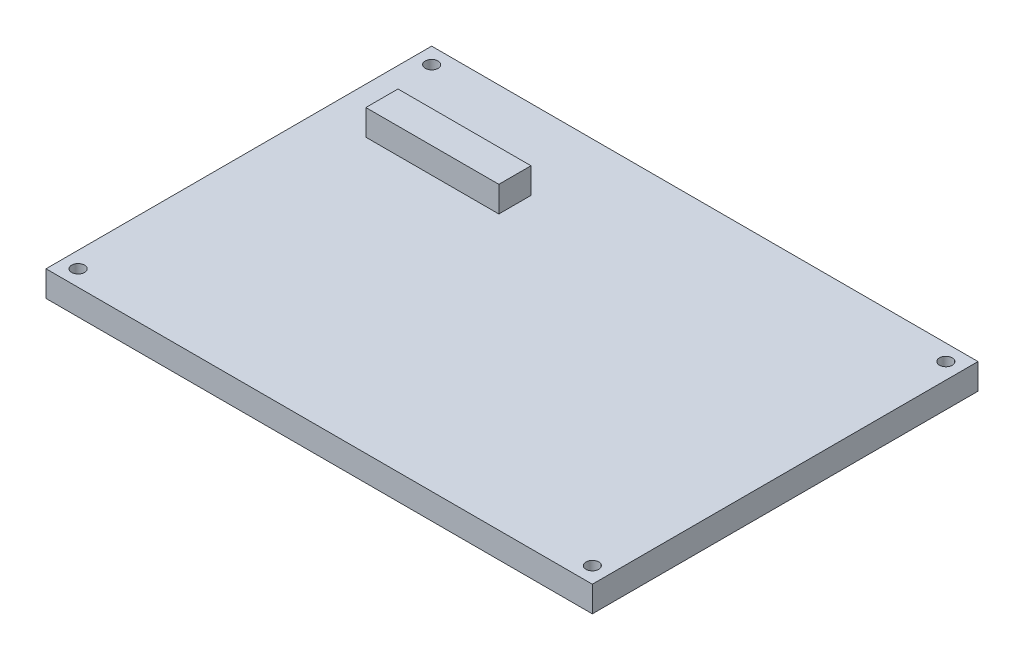
ISO-10303-21;
HEADER;
FILE_DESCRIPTION(('STEP AP214'),'2;1');
FILE_NAME('part.step','',(''),(''),'','','');
FILE_SCHEMA(('AUTOMOTIVE_DESIGN { 1 0 10303 214 1 1 1 1 }'));
ENDSEC;
DATA;
#1=APPLICATION_CONTEXT('core data for automotive mechanical design processes');
#2=APPLICATION_PROTOCOL_DEFINITION('international standard','automotive_design',2000,#1);
#3=PRODUCT_CONTEXT('',#1,'mechanical');
#4=PRODUCT('Part','Part','',(#3));
#5=PRODUCT_RELATED_PRODUCT_CATEGORY('part','',(#4));
#6=PRODUCT_DEFINITION_FORMATION('','',#4);
#7=PRODUCT_DEFINITION_CONTEXT('part definition',#1,'design');
#8=PRODUCT_DEFINITION('design','',#6,#7);
#9=PRODUCT_DEFINITION_SHAPE('','',#8);
#10=(LENGTH_UNIT() NAMED_UNIT(*) SI_UNIT(.MILLI.,.METRE.));
#11=(NAMED_UNIT(*) PLANE_ANGLE_UNIT() SI_UNIT($,.RADIAN.));
#12=(NAMED_UNIT(*) SI_UNIT($,.STERADIAN.) SOLID_ANGLE_UNIT());
#13=UNCERTAINTY_MEASURE_WITH_UNIT(LENGTH_MEASURE(1.E-05),#10,'distance_accuracy_value','');
#14=(GEOMETRIC_REPRESENTATION_CONTEXT(3) GLOBAL_UNCERTAINTY_ASSIGNED_CONTEXT((#13)) GLOBAL_UNIT_ASSIGNED_CONTEXT((#10,
#11,#12)) REPRESENTATION_CONTEXT('',''));
#15=CARTESIAN_POINT('',(0.,0.,0.));
#16=DIRECTION('',(0.,0.,1.));
#17=DIRECTION('',(1.,0.,0.));
#18=AXIS2_PLACEMENT_3D('',#15,#16,#17);
#19=CARTESIAN_POINT('',(0.,8.,0.));
#20=DIRECTION('',(0.,-1.,0.));
#21=DIRECTION('',(0.,0.,-1.));
#22=AXIS2_PLACEMENT_3D('',#19,#20,#21);
#23=PLANE('',#22);
#24=CARTESIAN_POINT('',(-80.,8.,55.));
#25=DIRECTION('',(0.,1.,0.));
#26=DIRECTION('',(0.,0.,1.));
#27=AXIS2_PLACEMENT_3D('',#24,#25,#26);
#28=CIRCLE('',#27,2.);
#29=CARTESIAN_POINT('',(-80.,8.,57.));
#30=VERTEX_POINT('',#29);
#31=EDGE_CURVE('E322',#30,#30,#28,.T.);
#32=ORIENTED_EDGE('',*,*,#31,.F.);
#33=EDGE_LOOP('',(#32));
#34=FACE_BOUND('',#33,.T.);
#35=CARTESIAN_POINT('',(80.,8.,-55.));
#36=DIRECTION('',(0.,1.,0.));
#37=DIRECTION('',(0.,0.,1.));
#38=AXIS2_PLACEMENT_3D('',#35,#36,#37);
#39=CIRCLE('',#38,2.);
#40=CARTESIAN_POINT('',(80.,8.,-53.));
#41=VERTEX_POINT('',#40);
#42=EDGE_CURVE('E328',#41,#41,#39,.T.);
#43=ORIENTED_EDGE('',*,*,#42,.F.);
#44=EDGE_LOOP('',(#43));
#45=FACE_BOUND('',#44,.T.);
#46=CARTESIAN_POINT('',(80.,8.,55.));
#47=DIRECTION('',(0.,1.,0.));
#48=DIRECTION('',(0.,0.,1.));
#49=AXIS2_PLACEMENT_3D('',#46,#47,#48);
#50=CIRCLE('',#49,2.);
#51=CARTESIAN_POINT('',(80.,8.,57.));
#52=VERTEX_POINT('',#51);
#53=EDGE_CURVE('E345',#52,#52,#50,.T.);
#54=ORIENTED_EDGE('',*,*,#53,.F.);
#55=EDGE_LOOP('',(#54));
#56=FACE_BOUND('',#55,.T.);
#57=CARTESIAN_POINT('',(-80.,8.,-55.));
#58=DIRECTION('',(0.,1.,0.));
#59=DIRECTION('',(0.,0.,1.));
#60=AXIS2_PLACEMENT_3D('',#57,#58,#59);
#61=CIRCLE('',#60,2.);
#62=CARTESIAN_POINT('',(-80.,8.,-53.));
#63=VERTEX_POINT('',#62);
#64=EDGE_CURVE('E325',#63,#63,#61,.T.);
#65=ORIENTED_EDGE('',*,*,#64,.F.);
#66=EDGE_LOOP('',(#65));
#67=FACE_BOUND('',#66,.T.);
#68=DIRECTION('',(-1.,0.,0.));
#69=VECTOR('',#68,1.);
#70=CARTESIAN_POINT('',(85.,8.,-60.));
#71=LINE('',#70,#69);
#72=CARTESIAN_POINT('',(85.,8.,-60.));
#73=VERTEX_POINT('',#72);
#74=CARTESIAN_POINT('',(-85.,8.,-60.));
#75=VERTEX_POINT('',#74);
#76=EDGE_CURVE('E140',#73,#75,#71,.T.);
#77=ORIENTED_EDGE('',*,*,#76,.T.);
#78=DIRECTION('',(0.,0.,-1.));
#79=VECTOR('',#78,1.);
#80=CARTESIAN_POINT('',(-85.,8.,60.));
#81=LINE('',#80,#79);
#82=CARTESIAN_POINT('',(-85.,8.,60.));
#83=VERTEX_POINT('',#82);
#84=EDGE_CURVE('E142',#83,#75,#81,.T.);
#85=ORIENTED_EDGE('',*,*,#84,.F.);
#86=DIRECTION('',(-1.,0.,0.));
#87=VECTOR('',#86,1.);
#88=CARTESIAN_POINT('',(85.,8.,60.));
#89=LINE('',#88,#87);
#90=CARTESIAN_POINT('',(85.,8.,60.));
#91=VERTEX_POINT('',#90);
#92=EDGE_CURVE('E146',#91,#83,#89,.T.);
#93=ORIENTED_EDGE('',*,*,#92,.F.);
#94=DIRECTION('',(0.,0.,-1.));
#95=VECTOR('',#94,1.);
#96=CARTESIAN_POINT('',(85.,8.,60.));
#97=LINE('',#96,#95);
#98=EDGE_CURVE('E149',#91,#73,#97,.T.);
#99=ORIENTED_EDGE('',*,*,#98,.T.);
#100=EDGE_LOOP('',(#77,#85,#93,#99));
#101=FACE_BOUND('',#100,.T.);
#102=DIRECTION('',(1.,0.,0.));
#103=VECTOR('',#102,1.);
#104=CARTESIAN_POINT('',(-70.6903133377905,7.99999999998136,-25.2149616158277));
#105=LINE('',#104,#103);
#106=CARTESIAN_POINT('',(-70.6903133377905,7.99999999998136,-25.2149616158277));
#107=VERTEX_POINT('',#106);
#108=CARTESIAN_POINT('',(-29.3096866622095,8.,-25.2149616158277));
#109=VERTEX_POINT('',#108);
#110=EDGE_CURVE('E116',#107,#109,#105,.T.);
#111=ORIENTED_EDGE('',*,*,#110,.F.);
#112=DIRECTION('',(0.,0.,1.));
#113=VECTOR('',#112,1.);
#114=CARTESIAN_POINT('',(-70.6903133377905,7.99999999998136,-35.2149616158277));
#115=LINE('',#114,#113);
#116=CARTESIAN_POINT('',(-70.6903133377905,8.,-35.2149616158277));
#117=VERTEX_POINT('',#116);
#118=EDGE_CURVE('E111',#117,#107,#115,.T.);
#119=ORIENTED_EDGE('',*,*,#118,.F.);
#120=DIRECTION('',(1.,0.,0.));
#121=VECTOR('',#120,1.);
#122=CARTESIAN_POINT('',(-70.6903133377905,7.99999999998136,-35.2149616158277));
#123=LINE('',#122,#121);
#124=CARTESIAN_POINT('',(-29.3096866622095,8.,-35.2149616158277));
#125=VERTEX_POINT('',#124);
#126=EDGE_CURVE('E56',#117,#125,#123,.T.);
#127=ORIENTED_EDGE('',*,*,#126,.T.);
#128=DIRECTION('',(0.,0.,1.));
#129=VECTOR('',#128,1.);
#130=CARTESIAN_POINT('',(-29.3096866622095,7.99999999998136,-35.2149616158277));
#131=LINE('',#130,#129);
#132=EDGE_CURVE('E51',#125,#109,#131,.T.);
#133=ORIENTED_EDGE('',*,*,#132,.T.);
#134=EDGE_LOOP('',(#111,#119,#127,#133));
#135=FACE_BOUND('',#134,.T.);
#136=ADVANCED_FACE('F36',(#34,#45,#56,#67,#101,#135),#23,.F.);
#137=CARTESIAN_POINT('',(85.,8.,-60.));
#138=DIRECTION('',(0.,0.,1.));
#139=DIRECTION('',(1.,0.,0.));
#140=AXIS2_PLACEMENT_3D('',#137,#138,#139);
#141=PLANE('',#140);
#142=DIRECTION('',(-1.,0.,0.));
#143=VECTOR('',#142,1.);
#144=CARTESIAN_POINT('',(85.,0.,-60.));
#145=LINE('',#144,#143);
#146=CARTESIAN_POINT('',(85.,0.,-60.));
#147=VERTEX_POINT('',#146);
#148=CARTESIAN_POINT('',(-85.,0.,-60.));
#149=VERTEX_POINT('',#148);
#150=EDGE_CURVE('E118',#147,#149,#145,.T.);
#151=ORIENTED_EDGE('',*,*,#150,.T.);
#152=DIRECTION('',(0.,-1.,0.));
#153=VECTOR('',#152,1.);
#154=CARTESIAN_POINT('',(-85.,8.,-60.));
#155=LINE('',#154,#153);
#156=EDGE_CURVE('E11',#75,#149,#155,.T.);
#157=ORIENTED_EDGE('',*,*,#156,.F.);
#158=ORIENTED_EDGE('',*,*,#76,.F.);
#159=DIRECTION('',(0.,-1.,0.));
#160=VECTOR('',#159,1.);
#161=CARTESIAN_POINT('',(85.,8.,-60.));
#162=LINE('',#161,#160);
#163=EDGE_CURVE('E151',#73,#147,#162,.T.);
#164=ORIENTED_EDGE('',*,*,#163,.T.);
#165=EDGE_LOOP('',(#151,#157,#158,#164));
#166=FACE_BOUND('',#165,.T.);
#167=ADVANCED_FACE('F38',(#166),#141,.F.);
#168=CARTESIAN_POINT('',(-85.,8.,60.));
#169=DIRECTION('',(-1.,0.,0.));
#170=DIRECTION('',(0.,0.,1.));
#171=AXIS2_PLACEMENT_3D('',#168,#169,#170);
#172=PLANE('',#171);
#173=DIRECTION('',(0.,0.,-1.));
#174=VECTOR('',#173,1.);
#175=CARTESIAN_POINT('',(-85.,0.,60.));
#176=LINE('',#175,#174);
#177=CARTESIAN_POINT('',(-85.,0.,60.));
#178=VERTEX_POINT('',#177);
#179=EDGE_CURVE('E154',#178,#149,#176,.T.);
#180=ORIENTED_EDGE('',*,*,#179,.F.);
#181=DIRECTION('',(0.,-1.,0.));
#182=VECTOR('',#181,1.);
#183=CARTESIAN_POINT('',(-85.,8.,60.));
#184=LINE('',#183,#182);
#185=EDGE_CURVE('E44',#83,#178,#184,.T.);
#186=ORIENTED_EDGE('',*,*,#185,.F.);
#187=ORIENTED_EDGE('',*,*,#84,.T.);
#188=ORIENTED_EDGE('',*,*,#156,.T.);
#189=EDGE_LOOP('',(#180,#186,#187,#188));
#190=FACE_BOUND('',#189,.T.);
#191=ADVANCED_FACE('F171',(#190),#172,.T.);
#192=CARTESIAN_POINT('',(85.,8.,60.));
#193=DIRECTION('',(0.,0.,1.));
#194=DIRECTION('',(1.,0.,0.));
#195=AXIS2_PLACEMENT_3D('',#192,#193,#194);
#196=PLANE('',#195);
#197=DIRECTION('',(-1.,0.,0.));
#198=VECTOR('',#197,1.);
#199=CARTESIAN_POINT('',(85.,0.,60.));
#200=LINE('',#199,#198);
#201=CARTESIAN_POINT('',(85.,0.,60.));
#202=VERTEX_POINT('',#201);
#203=EDGE_CURVE('E157',#202,#178,#200,.T.);
#204=ORIENTED_EDGE('',*,*,#203,.F.);
#205=DIRECTION('',(0.,-1.,0.));
#206=VECTOR('',#205,1.);
#207=CARTESIAN_POINT('',(85.,8.,60.));
#208=LINE('',#207,#206);
#209=EDGE_CURVE('E163',#91,#202,#208,.T.);
#210=ORIENTED_EDGE('',*,*,#209,.F.);
#211=ORIENTED_EDGE('',*,*,#92,.T.);
#212=ORIENTED_EDGE('',*,*,#185,.T.);
#213=EDGE_LOOP('',(#204,#210,#211,#212));
#214=FACE_BOUND('',#213,.T.);
#215=ADVANCED_FACE('F167',(#214),#196,.T.);
#216=CARTESIAN_POINT('',(85.,8.,60.));
#217=DIRECTION('',(-1.,0.,0.));
#218=DIRECTION('',(0.,0.,1.));
#219=AXIS2_PLACEMENT_3D('',#216,#217,#218);
#220=PLANE('',#219);
#221=DIRECTION('',(0.,0.,-1.));
#222=VECTOR('',#221,1.);
#223=CARTESIAN_POINT('',(85.,0.,60.));
#224=LINE('',#223,#222);
#225=EDGE_CURVE('E143',#202,#147,#224,.T.);
#226=ORIENTED_EDGE('',*,*,#225,.T.);
#227=ORIENTED_EDGE('',*,*,#163,.F.);
#228=ORIENTED_EDGE('',*,*,#98,.F.);
#229=ORIENTED_EDGE('',*,*,#209,.T.);
#230=EDGE_LOOP('',(#226,#227,#228,#229));
#231=FACE_BOUND('',#230,.T.);
#232=ADVANCED_FACE('F179',(#231),#220,.F.);
#233=CARTESIAN_POINT('',(0.,0.,0.));
#234=DIRECTION('',(0.,-1.,0.));
#235=DIRECTION('',(0.,0.,-1.));
#236=AXIS2_PLACEMENT_3D('',#233,#234,#235);
#237=PLANE('',#236);
#238=CARTESIAN_POINT('',(-80.,0.,55.));
#239=DIRECTION('',(0.,1.,0.));
#240=DIRECTION('',(0.,0.,1.));
#241=AXIS2_PLACEMENT_3D('',#238,#239,#240);
#242=CIRCLE('',#241,2.);
#243=CARTESIAN_POINT('',(-80.,0.,57.));
#244=VERTEX_POINT('',#243);
#245=EDGE_CURVE('E319',#244,#244,#242,.T.);
#246=ORIENTED_EDGE('',*,*,#245,.T.);
#247=EDGE_LOOP('',(#246));
#248=FACE_BOUND('',#247,.T.);
#249=CARTESIAN_POINT('',(80.,0.,-55.));
#250=DIRECTION('',(0.,1.,0.));
#251=DIRECTION('',(0.,0.,1.));
#252=AXIS2_PLACEMENT_3D('',#249,#250,#251);
#253=CIRCLE('',#252,2.);
#254=CARTESIAN_POINT('',(80.,0.,-53.));
#255=VERTEX_POINT('',#254);
#256=EDGE_CURVE('E323',#255,#255,#253,.T.);
#257=ORIENTED_EDGE('',*,*,#256,.T.);
#258=EDGE_LOOP('',(#257));
#259=FACE_BOUND('',#258,.T.);
#260=CARTESIAN_POINT('',(80.,0.,55.));
#261=DIRECTION('',(0.,1.,0.));
#262=DIRECTION('',(0.,0.,1.));
#263=AXIS2_PLACEMENT_3D('',#260,#261,#262);
#264=CIRCLE('',#263,2.);
#265=CARTESIAN_POINT('',(80.,0.,57.));
#266=VERTEX_POINT('',#265);
#267=EDGE_CURVE('E334',#266,#266,#264,.T.);
#268=ORIENTED_EDGE('',*,*,#267,.T.);
#269=EDGE_LOOP('',(#268));
#270=FACE_BOUND('',#269,.T.);
#271=CARTESIAN_POINT('',(-80.,0.,-55.));
#272=DIRECTION('',(0.,1.,0.));
#273=DIRECTION('',(0.,0.,1.));
#274=AXIS2_PLACEMENT_3D('',#271,#272,#273);
#275=CIRCLE('',#274,2.);
#276=CARTESIAN_POINT('',(-80.,0.,-53.));
#277=VERTEX_POINT('',#276);
#278=EDGE_CURVE('E130',#277,#277,#275,.T.);
#279=ORIENTED_EDGE('',*,*,#278,.T.);
#280=EDGE_LOOP('',(#279));
#281=FACE_BOUND('',#280,.T.);
#282=ORIENTED_EDGE('',*,*,#150,.F.);
#283=ORIENTED_EDGE('',*,*,#225,.F.);
#284=ORIENTED_EDGE('',*,*,#203,.T.);
#285=ORIENTED_EDGE('',*,*,#179,.T.);
#286=EDGE_LOOP('',(#282,#283,#284,#285));
#287=FACE_BOUND('',#286,.T.);
#288=ADVANCED_FACE('F176',(#248,#259,#270,#281,#287),#237,.T.);
#289=CARTESIAN_POINT('',(-70.6903133377905,15.9999999999814,-25.2149616158277));
#290=DIRECTION('',(0.,0.,-1.));
#291=DIRECTION('',(-1.,0.,0.));
#292=AXIS2_PLACEMENT_3D('',#289,#290,#291);
#293=PLANE('',#292);
#294=ORIENTED_EDGE('',*,*,#110,.T.);
#295=DIRECTION('',(0.,-1.,0.));
#296=VECTOR('',#295,1.);
#297=CARTESIAN_POINT('',(-29.3096866622095,15.9999999999814,-25.2149616158277));
#298=LINE('',#297,#296);
#299=CARTESIAN_POINT('',(-29.3096866622095,15.9999999999814,-25.2149616158277));
#300=VERTEX_POINT('',#299);
#301=EDGE_CURVE('E114',#300,#109,#298,.T.);
#302=ORIENTED_EDGE('',*,*,#301,.F.);
#303=DIRECTION('',(1.,0.,0.));
#304=VECTOR('',#303,1.);
#305=CARTESIAN_POINT('',(-70.6903133377905,15.9999999999814,-25.2149616158277));
#306=LINE('',#305,#304);
#307=CARTESIAN_POINT('',(-70.6903133377905,15.9999999999814,-25.2149616158277));
#308=VERTEX_POINT('',#307);
#309=EDGE_CURVE('E99',#308,#300,#306,.T.);
#310=ORIENTED_EDGE('',*,*,#309,.F.);
#311=DIRECTION('',(0.,-1.,0.));
#312=VECTOR('',#311,1.);
#313=CARTESIAN_POINT('',(-70.6903133377905,15.9999999999814,-25.2149616158277));
#314=LINE('',#313,#312);
#315=EDGE_CURVE('E128',#308,#107,#314,.T.);
#316=ORIENTED_EDGE('',*,*,#315,.T.);
#317=EDGE_LOOP('',(#294,#302,#310,#316));
#318=FACE_BOUND('',#317,.T.);
#319=ADVANCED_FACE('F115',(#318),#293,.F.);
#320=CARTESIAN_POINT('',(-29.3096866622095,15.9999999999814,-35.2149616158277));
#321=DIRECTION('',(1.,0.,0.));
#322=DIRECTION('',(0.,0.,-1.));
#323=AXIS2_PLACEMENT_3D('',#320,#321,#322);
#324=PLANE('',#323);
#325=ORIENTED_EDGE('',*,*,#132,.F.);
#326=DIRECTION('',(0.,-1.,0.));
#327=VECTOR('',#326,1.);
#328=CARTESIAN_POINT('',(-29.3096866622095,15.9999999999814,-35.2149616158277));
#329=LINE('',#328,#327);
#330=CARTESIAN_POINT('',(-29.3096866622095,15.9999999999814,-35.2149616158277));
#331=VERTEX_POINT('',#330);
#332=EDGE_CURVE('E119',#331,#125,#329,.T.);
#333=ORIENTED_EDGE('',*,*,#332,.F.);
#334=DIRECTION('',(0.,0.,1.));
#335=VECTOR('',#334,1.);
#336=CARTESIAN_POINT('',(-29.3096866622095,15.9999999999814,-35.2149616158277));
#337=LINE('',#336,#335);
#338=EDGE_CURVE('E104',#331,#300,#337,.T.);
#339=ORIENTED_EDGE('',*,*,#338,.T.);
#340=ORIENTED_EDGE('',*,*,#301,.T.);
#341=EDGE_LOOP('',(#325,#333,#339,#340));
#342=FACE_BOUND('',#341,.T.);
#343=ADVANCED_FACE('F121',(#342),#324,.T.);
#344=CARTESIAN_POINT('',(-70.6903133377905,15.9999999999814,-35.2149616158277));
#345=DIRECTION('',(0.,0.,-1.));
#346=DIRECTION('',(-1.,0.,0.));
#347=AXIS2_PLACEMENT_3D('',#344,#345,#346);
#348=PLANE('',#347);
#349=ORIENTED_EDGE('',*,*,#126,.F.);
#350=DIRECTION('',(0.,-1.,0.));
#351=VECTOR('',#350,1.);
#352=CARTESIAN_POINT('',(-70.6903133377905,15.9999999999814,-35.2149616158277));
#353=LINE('',#352,#351);
#354=CARTESIAN_POINT('',(-70.6903133377905,15.9999999999814,-35.2149616158277));
#355=VERTEX_POINT('',#354);
#356=EDGE_CURVE('E136',#355,#117,#353,.T.);
#357=ORIENTED_EDGE('',*,*,#356,.F.);
#358=DIRECTION('',(1.,0.,0.));
#359=VECTOR('',#358,1.);
#360=CARTESIAN_POINT('',(-70.6903133377905,15.9999999999814,-35.2149616158277));
#361=LINE('',#360,#359);
#362=EDGE_CURVE('E122',#355,#331,#361,.T.);
#363=ORIENTED_EDGE('',*,*,#362,.T.);
#364=ORIENTED_EDGE('',*,*,#332,.T.);
#365=EDGE_LOOP('',(#349,#357,#363,#364));
#366=FACE_BOUND('',#365,.T.);
#367=ADVANCED_FACE('F190',(#366),#348,.T.);
#368=CARTESIAN_POINT('',(-70.6903133377905,15.9999999999814,-35.2149616158277));
#369=DIRECTION('',(1.,0.,0.));
#370=DIRECTION('',(0.,0.,-1.));
#371=AXIS2_PLACEMENT_3D('',#368,#369,#370);
#372=PLANE('',#371);
#373=ORIENTED_EDGE('',*,*,#118,.T.);
#374=ORIENTED_EDGE('',*,*,#315,.F.);
#375=DIRECTION('',(0.,0.,1.));
#376=VECTOR('',#375,1.);
#377=CARTESIAN_POINT('',(-70.6903133377905,15.9999999999814,-35.2149616158277));
#378=LINE('',#377,#376);
#379=EDGE_CURVE('E107',#355,#308,#378,.T.);
#380=ORIENTED_EDGE('',*,*,#379,.F.);
#381=ORIENTED_EDGE('',*,*,#356,.T.);
#382=EDGE_LOOP('',(#373,#374,#380,#381));
#383=FACE_BOUND('',#382,.T.);
#384=ADVANCED_FACE('F188',(#383),#372,.F.);
#385=CARTESIAN_POINT('',(0.,15.9999999999814,0.));
#386=DIRECTION('',(0.,-1.,0.));
#387=DIRECTION('',(0.,0.,-1.));
#388=AXIS2_PLACEMENT_3D('',#385,#386,#387);
#389=PLANE('',#388);
#390=ORIENTED_EDGE('',*,*,#309,.T.);
#391=ORIENTED_EDGE('',*,*,#338,.F.);
#392=ORIENTED_EDGE('',*,*,#362,.F.);
#393=ORIENTED_EDGE('',*,*,#379,.T.);
#394=EDGE_LOOP('',(#390,#391,#392,#393));
#395=FACE_BOUND('',#394,.T.);
#396=ADVANCED_FACE('F101',(#395),#389,.F.);
#397=CARTESIAN_POINT('',(-80.,0.,-55.));
#398=DIRECTION('',(0.,1.,0.));
#399=DIRECTION('',(0.,0.,1.));
#400=AXIS2_PLACEMENT_3D('',#397,#398,#399);
#401=CYLINDRICAL_SURFACE('',#400,2.);
#402=ORIENTED_EDGE('',*,*,#278,.F.);
#403=EDGE_LOOP('',(#402));
#404=FACE_BOUND('',#403,.T.);
#405=ORIENTED_EDGE('',*,*,#64,.T.);
#406=EDGE_LOOP('',(#405));
#407=FACE_BOUND('',#406,.T.);
#408=ADVANCED_FACE('F237',(#404,#407),#401,.F.);
#409=CARTESIAN_POINT('',(80.,0.,55.));
#410=DIRECTION('',(0.,1.,0.));
#411=DIRECTION('',(0.,0.,1.));
#412=AXIS2_PLACEMENT_3D('',#409,#410,#411);
#413=CYLINDRICAL_SURFACE('',#412,2.);
#414=ORIENTED_EDGE('',*,*,#267,.F.);
#415=EDGE_LOOP('',(#414));
#416=FACE_BOUND('',#415,.T.);
#417=ORIENTED_EDGE('',*,*,#53,.T.);
#418=EDGE_LOOP('',(#417));
#419=FACE_BOUND('',#418,.T.);
#420=ADVANCED_FACE('F242',(#416,#419),#413,.F.);
#421=CARTESIAN_POINT('',(80.,0.,-55.));
#422=DIRECTION('',(0.,1.,0.));
#423=DIRECTION('',(0.,0.,1.));
#424=AXIS2_PLACEMENT_3D('',#421,#422,#423);
#425=CYLINDRICAL_SURFACE('',#424,2.);
#426=ORIENTED_EDGE('',*,*,#256,.F.);
#427=EDGE_LOOP('',(#426));
#428=FACE_BOUND('',#427,.T.);
#429=ORIENTED_EDGE('',*,*,#42,.T.);
#430=EDGE_LOOP('',(#429));
#431=FACE_BOUND('',#430,.T.);
#432=ADVANCED_FACE('F252',(#428,#431),#425,.F.);
#433=CARTESIAN_POINT('',(-80.,0.,55.));
#434=DIRECTION('',(0.,1.,0.));
#435=DIRECTION('',(0.,0.,1.));
#436=AXIS2_PLACEMENT_3D('',#433,#434,#435);
#437=CYLINDRICAL_SURFACE('',#436,2.);
#438=ORIENTED_EDGE('',*,*,#245,.F.);
#439=EDGE_LOOP('',(#438));
#440=FACE_BOUND('',#439,.T.);
#441=ORIENTED_EDGE('',*,*,#31,.T.);
#442=EDGE_LOOP('',(#441));
#443=FACE_BOUND('',#442,.T.);
#444=ADVANCED_FACE('F262',(#440,#443),#437,.F.);
#445=CLOSED_SHELL('',(#136,#167,#191,#215,#232,#288,#319,#343,#367,#384,#396,#408,#420,#432,#444));
#446=MANIFOLD_SOLID_BREP('B2',#445);
#447=ADVANCED_BREP_SHAPE_REPRESENTATION('',(#18,#446),#14);
#448=SHAPE_DEFINITION_REPRESENTATION(#9,#447);
ENDSEC;
END-ISO-10303-21;
